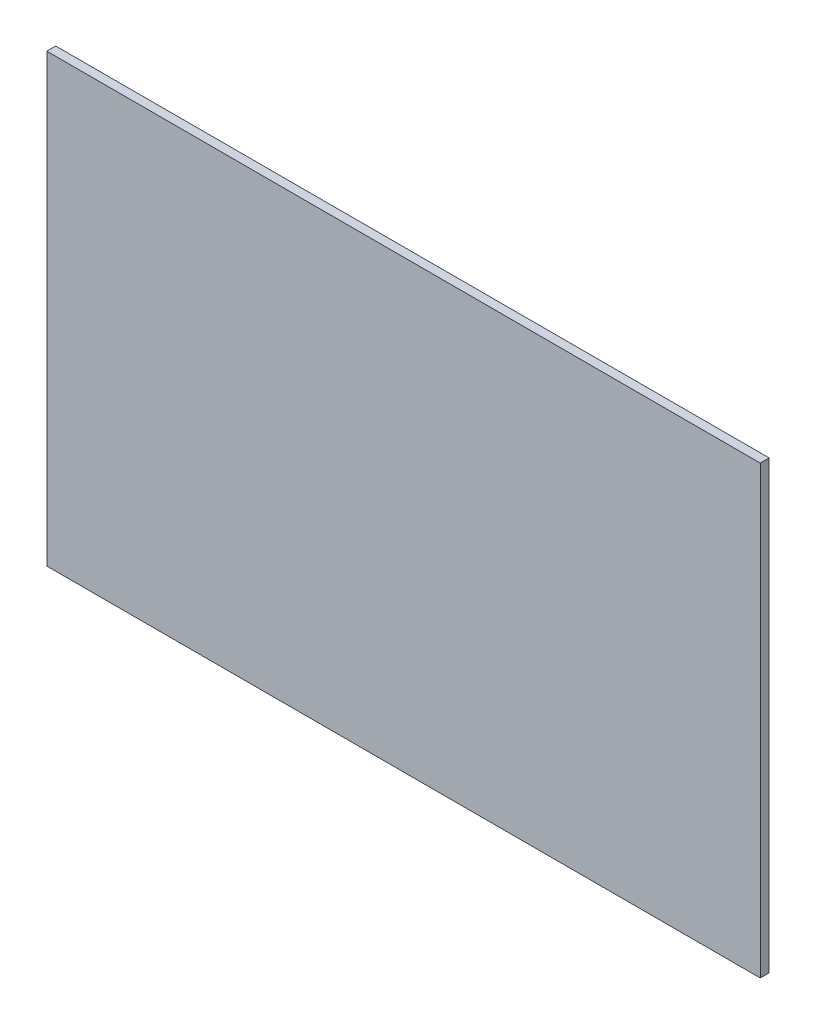
ISO-10303-21;
HEADER;
FILE_DESCRIPTION(('STEP AP214'),'2;1');
FILE_NAME('part.step','',(''),(''),'','','');
FILE_SCHEMA(('AUTOMOTIVE_DESIGN { 1 0 10303 214 1 1 1 1 }'));
ENDSEC;
DATA;
#1=APPLICATION_CONTEXT('core data for automotive mechanical design processes');
#2=APPLICATION_PROTOCOL_DEFINITION('international standard','automotive_design',2000,#1);
#3=PRODUCT_CONTEXT('',#1,'mechanical');
#4=PRODUCT('Part','Part','',(#3));
#5=PRODUCT_RELATED_PRODUCT_CATEGORY('part','',(#4));
#6=PRODUCT_DEFINITION_FORMATION('','',#4);
#7=PRODUCT_DEFINITION_CONTEXT('part definition',#1,'design');
#8=PRODUCT_DEFINITION('design','',#6,#7);
#9=PRODUCT_DEFINITION_SHAPE('','',#8);
#10=(LENGTH_UNIT() NAMED_UNIT(*) SI_UNIT(.MILLI.,.METRE.));
#11=(NAMED_UNIT(*) PLANE_ANGLE_UNIT() SI_UNIT($,.RADIAN.));
#12=(NAMED_UNIT(*) SI_UNIT($,.STERADIAN.) SOLID_ANGLE_UNIT());
#13=UNCERTAINTY_MEASURE_WITH_UNIT(LENGTH_MEASURE(1.E-05),#10,'distance_accuracy_value','');
#14=(GEOMETRIC_REPRESENTATION_CONTEXT(3) GLOBAL_UNCERTAINTY_ASSIGNED_CONTEXT((#13)) GLOBAL_UNIT_ASSIGNED_CONTEXT((#10,
#11,#12)) REPRESENTATION_CONTEXT('',''));
#15=CARTESIAN_POINT('',(0.,0.,0.));
#16=DIRECTION('',(0.,0.,1.));
#17=DIRECTION('',(1.,0.,0.));
#18=AXIS2_PLACEMENT_3D('',#15,#16,#17);
#19=CARTESIAN_POINT('',(-80.,50.,2.));
#20=DIRECTION('',(1.,0.,0.));
#21=DIRECTION('',(0.,1.,0.));
#22=AXIS2_PLACEMENT_3D('',#19,#20,#21);
#23=PLANE('',#22);
#24=DIRECTION('',(0.,-1.,0.));
#25=VECTOR('',#24,1.);
#26=CARTESIAN_POINT('',(-80.,50.,0.));
#27=LINE('',#26,#25);
#28=CARTESIAN_POINT('',(-80.,50.,0.));
#29=VERTEX_POINT('',#28);
#30=CARTESIAN_POINT('',(-80.,-50.,0.));
#31=VERTEX_POINT('',#30);
#32=EDGE_CURVE('E96',#29,#31,#27,.T.);
#33=ORIENTED_EDGE('',*,*,#32,.T.);
#34=DIRECTION('',(0.,0.,-1.));
#35=VECTOR('',#34,1.);
#36=CARTESIAN_POINT('',(-80.,-50.,2.));
#37=LINE('',#36,#35);
#38=CARTESIAN_POINT('',(-80.,-50.,2.));
#39=VERTEX_POINT('',#38);
#40=EDGE_CURVE('E11',#39,#31,#37,.T.);
#41=ORIENTED_EDGE('',*,*,#40,.F.);
#42=DIRECTION('',(0.,-1.,0.));
#43=VECTOR('',#42,1.);
#44=CARTESIAN_POINT('',(-80.,50.,2.));
#45=LINE('',#44,#43);
#46=CARTESIAN_POINT('',(-80.,50.,2.));
#47=VERTEX_POINT('',#46);
#48=EDGE_CURVE('E84',#47,#39,#45,.T.);
#49=ORIENTED_EDGE('',*,*,#48,.F.);
#50=DIRECTION('',(0.,0.,-1.));
#51=VECTOR('',#50,1.);
#52=CARTESIAN_POINT('',(-80.,50.,2.));
#53=LINE('',#52,#51);
#54=EDGE_CURVE('E92',#47,#29,#53,.T.);
#55=ORIENTED_EDGE('',*,*,#54,.T.);
#56=EDGE_LOOP('',(#33,#41,#49,#55));
#57=FACE_BOUND('',#56,.T.);
#58=ADVANCED_FACE('F33',(#57),#23,.F.);
#59=CARTESIAN_POINT('',(-80.,-50.,2.));
#60=DIRECTION('',(0.,1.,0.));
#61=DIRECTION('',(0.,0.,1.));
#62=AXIS2_PLACEMENT_3D('',#59,#60,#61);
#63=PLANE('',#62);
#64=DIRECTION('',(1.,0.,0.));
#65=VECTOR('',#64,1.);
#66=CARTESIAN_POINT('',(-80.,-50.,0.));
#67=LINE('',#66,#65);
#68=CARTESIAN_POINT('',(80.,-50.,0.));
#69=VERTEX_POINT('',#68);
#70=EDGE_CURVE('E88',#31,#69,#67,.T.);
#71=ORIENTED_EDGE('',*,*,#70,.T.);
#72=DIRECTION('',(0.,0.,-1.));
#73=VECTOR('',#72,1.);
#74=CARTESIAN_POINT('',(80.,-50.,2.));
#75=LINE('',#74,#73);
#76=CARTESIAN_POINT('',(80.,-50.,2.));
#77=VERTEX_POINT('',#76);
#78=EDGE_CURVE('E41',#77,#69,#75,.T.);
#79=ORIENTED_EDGE('',*,*,#78,.F.);
#80=DIRECTION('',(1.,0.,0.));
#81=VECTOR('',#80,1.);
#82=CARTESIAN_POINT('',(-80.,-50.,2.));
#83=LINE('',#82,#81);
#84=EDGE_CURVE('E79',#39,#77,#83,.T.);
#85=ORIENTED_EDGE('',*,*,#84,.F.);
#86=ORIENTED_EDGE('',*,*,#40,.T.);
#87=EDGE_LOOP('',(#71,#79,#85,#86));
#88=FACE_BOUND('',#87,.T.);
#89=ADVANCED_FACE('F87',(#88),#63,.F.);
#90=CARTESIAN_POINT('',(80.,50.,2.));
#91=DIRECTION('',(-1.,0.,0.));
#92=DIRECTION('',(0.,0.,1.));
#93=AXIS2_PLACEMENT_3D('',#90,#91,#92);
#94=PLANE('',#93);
#95=DIRECTION('',(0.,1.,0.));
#96=VECTOR('',#95,1.);
#97=CARTESIAN_POINT('',(80.,50.,0.));
#98=LINE('',#97,#96);
#99=CARTESIAN_POINT('',(80.,50.,0.));
#100=VERTEX_POINT('',#99);
#101=EDGE_CURVE('E66',#69,#100,#98,.T.);
#102=ORIENTED_EDGE('',*,*,#101,.T.);
#103=DIRECTION('',(0.,0.,-1.));
#104=VECTOR('',#103,1.);
#105=CARTESIAN_POINT('',(80.,50.,2.));
#106=LINE('',#105,#104);
#107=CARTESIAN_POINT('',(80.,50.,2.));
#108=VERTEX_POINT('',#107);
#109=EDGE_CURVE('E89',#108,#100,#106,.T.);
#110=ORIENTED_EDGE('',*,*,#109,.F.);
#111=DIRECTION('',(0.,1.,0.));
#112=VECTOR('',#111,1.);
#113=CARTESIAN_POINT('',(80.,50.,2.));
#114=LINE('',#113,#112);
#115=EDGE_CURVE('E82',#77,#108,#114,.T.);
#116=ORIENTED_EDGE('',*,*,#115,.F.);
#117=ORIENTED_EDGE('',*,*,#78,.T.);
#118=EDGE_LOOP('',(#102,#110,#116,#117));
#119=FACE_BOUND('',#118,.T.);
#120=ADVANCED_FACE('F90',(#119),#94,.F.);
#121=CARTESIAN_POINT('',(-80.,50.,2.));
#122=DIRECTION('',(0.,-1.,0.));
#123=DIRECTION('',(0.,0.,-1.));
#124=AXIS2_PLACEMENT_3D('',#121,#122,#123);
#125=PLANE('',#124);
#126=DIRECTION('',(-1.,0.,0.));
#127=VECTOR('',#126,1.);
#128=CARTESIAN_POINT('',(-80.,50.,0.));
#129=LINE('',#128,#127);
#130=EDGE_CURVE('E72',#100,#29,#129,.T.);
#131=ORIENTED_EDGE('',*,*,#130,.T.);
#132=ORIENTED_EDGE('',*,*,#54,.F.);
#133=DIRECTION('',(-1.,0.,0.));
#134=VECTOR('',#133,1.);
#135=CARTESIAN_POINT('',(-80.,50.,2.));
#136=LINE('',#135,#134);
#137=EDGE_CURVE('E49',#108,#47,#136,.T.);
#138=ORIENTED_EDGE('',*,*,#137,.F.);
#139=ORIENTED_EDGE('',*,*,#109,.T.);
#140=EDGE_LOOP('',(#131,#132,#138,#139));
#141=FACE_BOUND('',#140,.T.);
#142=ADVANCED_FACE('F103',(#141),#125,.F.);
#143=CARTESIAN_POINT('',(0.,0.,2.));
#144=DIRECTION('',(0.,0.,1.));
#145=DIRECTION('',(1.,0.,0.));
#146=AXIS2_PLACEMENT_3D('',#143,#144,#145);
#147=PLANE('',#146);
#148=ORIENTED_EDGE('',*,*,#48,.T.);
#149=ORIENTED_EDGE('',*,*,#84,.T.);
#150=ORIENTED_EDGE('',*,*,#115,.T.);
#151=ORIENTED_EDGE('',*,*,#137,.T.);
#152=EDGE_LOOP('',(#148,#149,#150,#151));
#153=FACE_BOUND('',#152,.T.);
#154=ADVANCED_FACE('F80',(#153),#147,.T.);
#155=CARTESIAN_POINT('',(0.,0.,0.));
#156=DIRECTION('',(0.,0.,1.));
#157=DIRECTION('',(1.,0.,0.));
#158=AXIS2_PLACEMENT_3D('',#155,#156,#157);
#159=PLANE('',#158);
#160=ORIENTED_EDGE('',*,*,#32,.F.);
#161=ORIENTED_EDGE('',*,*,#130,.F.);
#162=ORIENTED_EDGE('',*,*,#101,.F.);
#163=ORIENTED_EDGE('',*,*,#70,.F.);
#164=EDGE_LOOP('',(#160,#161,#162,#163));
#165=FACE_BOUND('',#164,.T.);
#166=ADVANCED_FACE('F106',(#165),#159,.F.);
#167=CLOSED_SHELL('',(#58,#89,#120,#142,#154,#166));
#168=MANIFOLD_SOLID_BREP('B2',#167);
#169=ADVANCED_BREP_SHAPE_REPRESENTATION('',(#18,#168),#14);
#170=SHAPE_DEFINITION_REPRESENTATION(#9,#169);
ENDSEC;
END-ISO-10303-21;
